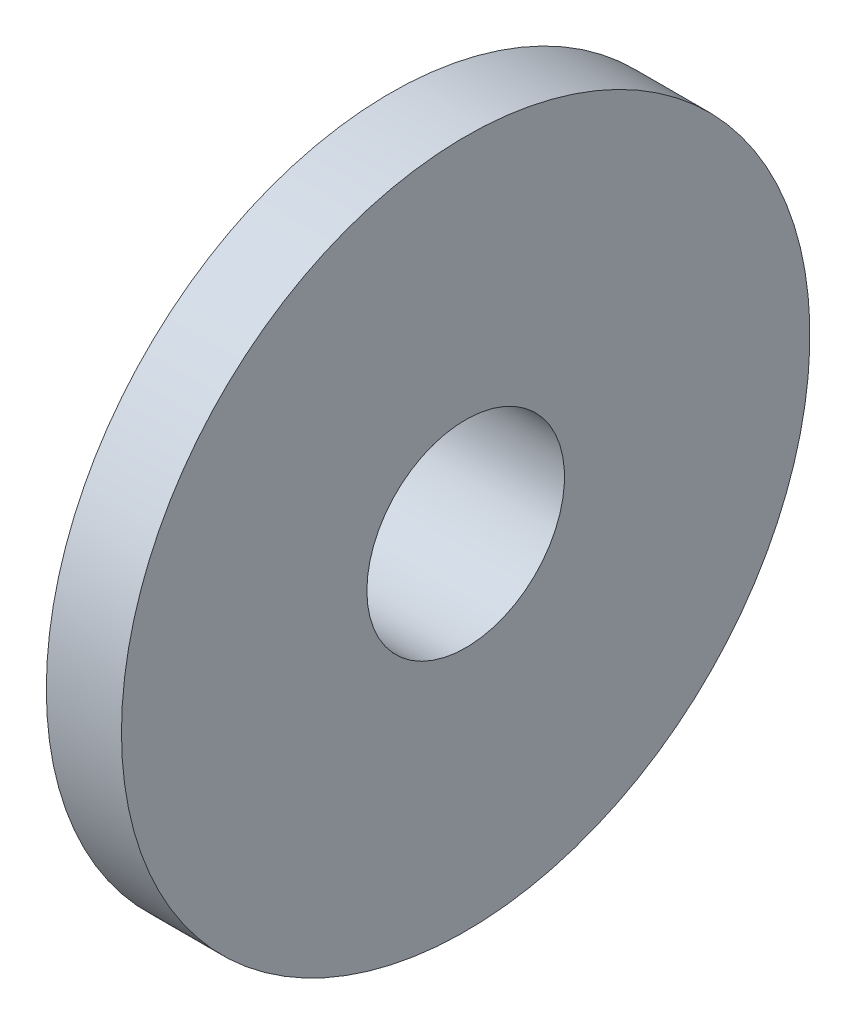
ISO-10303-21;
HEADER;
FILE_DESCRIPTION(('STEP AP214'),'2;1');
FILE_NAME('part.step','',(''),(''),'','','');
FILE_SCHEMA(('AUTOMOTIVE_DESIGN { 1 0 10303 214 1 1 1 1 }'));
ENDSEC;
DATA;
#1=APPLICATION_CONTEXT('core data for automotive mechanical design processes');
#2=APPLICATION_PROTOCOL_DEFINITION('international standard','automotive_design',2000,#1);
#3=PRODUCT_CONTEXT('',#1,'mechanical');
#4=PRODUCT('Part','Part','',(#3));
#5=PRODUCT_RELATED_PRODUCT_CATEGORY('part','',(#4));
#6=PRODUCT_DEFINITION_FORMATION('','',#4);
#7=PRODUCT_DEFINITION_CONTEXT('part definition',#1,'design');
#8=PRODUCT_DEFINITION('design','',#6,#7);
#9=PRODUCT_DEFINITION_SHAPE('','',#8);
#10=(LENGTH_UNIT() NAMED_UNIT(*) SI_UNIT(.MILLI.,.METRE.));
#11=(NAMED_UNIT(*) PLANE_ANGLE_UNIT() SI_UNIT($,.RADIAN.));
#12=(NAMED_UNIT(*) SI_UNIT($,.STERADIAN.) SOLID_ANGLE_UNIT());
#13=UNCERTAINTY_MEASURE_WITH_UNIT(LENGTH_MEASURE(1.E-05),#10,'distance_accuracy_value','');
#14=(GEOMETRIC_REPRESENTATION_CONTEXT(3) GLOBAL_UNCERTAINTY_ASSIGNED_CONTEXT((#13)) GLOBAL_UNIT_ASSIGNED_CONTEXT((#10,
#11,#12)) REPRESENTATION_CONTEXT('',''));
#15=CARTESIAN_POINT('',(0.,0.,0.));
#16=DIRECTION('',(0.,0.,1.));
#17=DIRECTION('',(1.,0.,0.));
#18=AXIS2_PLACEMENT_3D('',#15,#16,#17);
#19=CARTESIAN_POINT('',(-12.0675062027476,0.,-3.00690540133662));
#20=DIRECTION('',(-1.,0.,0.));
#21=DIRECTION('',(0.,0.,1.));
#22=AXIS2_PLACEMENT_3D('',#19,#20,#21);
#23=CYLINDRICAL_SURFACE('',#22,13.2261625659578);
#24=CARTESIAN_POINT('',(-8.73505679111022,0.,-3.00690540133662));
#25=DIRECTION('',(-1.,0.,0.));
#26=DIRECTION('',(0.,0.,1.));
#27=AXIS2_PLACEMENT_3D('',#24,#25,#26);
#28=CIRCLE('',#27,13.2261625659578);
#29=CARTESIAN_POINT('',(-8.73505679111022,0.,10.2192571646212));
#30=VERTEX_POINT('',#29);
#31=EDGE_CURVE('E10',#30,#30,#28,.T.);
#32=ORIENTED_EDGE('',*,*,#31,.F.);
#33=EDGE_LOOP('',(#32));
#34=FACE_BOUND('',#33,.T.);
#35=CARTESIAN_POINT('',(-4.36752839555511,0.,-3.00690540133662));
#36=DIRECTION('',(-1.,0.,0.));
#37=DIRECTION('',(0.,0.,1.));
#38=AXIS2_PLACEMENT_3D('',#35,#36,#37);
#39=CIRCLE('',#38,13.2261625659578);
#40=CARTESIAN_POINT('',(-4.36752839555511,0.,10.2192571646212));
#41=VERTEX_POINT('',#40);
#42=EDGE_CURVE('E64',#41,#41,#39,.T.);
#43=ORIENTED_EDGE('',*,*,#42,.T.);
#44=EDGE_LOOP('',(#43));
#45=FACE_BOUND('',#44,.T.);
#46=ADVANCED_FACE('F37',(#34,#45),#23,.T.);
#47=CARTESIAN_POINT('',(-8.73505679111022,0.,-16.2330679672944));
#48=DIRECTION('',(1.,0.,0.));
#49=DIRECTION('',(0.,0.,-1.));
#50=AXIS2_PLACEMENT_3D('',#47,#48,#49);
#51=PLANE('',#50);
#52=CARTESIAN_POINT('',(-8.73505679111022,0.,-3.00690540133662));
#53=DIRECTION('',(-1.,0.,0.));
#54=DIRECTION('',(0.,0.,1.));
#55=AXIS2_PLACEMENT_3D('',#52,#53,#54);
#56=CIRCLE('',#55,5.74100121775776);
#57=CARTESIAN_POINT('',(-8.73505679111022,0.,2.73409581642113));
#58=VERTEX_POINT('',#57);
#59=EDGE_CURVE('E44',#58,#58,#56,.T.);
#60=ORIENTED_EDGE('',*,*,#59,.F.);
#61=EDGE_LOOP('',(#60));
#62=FACE_BOUND('',#61,.T.);
#63=ORIENTED_EDGE('',*,*,#31,.T.);
#64=EDGE_LOOP('',(#63));
#65=FACE_BOUND('',#64,.T.);
#66=ADVANCED_FACE('F90',(#62,#65),#51,.F.);
#67=CARTESIAN_POINT('',(-12.0675062027476,0.,-3.00690540133662));
#68=DIRECTION('',(-1.,0.,0.));
#69=DIRECTION('',(0.,0.,1.));
#70=AXIS2_PLACEMENT_3D('',#67,#68,#69);
#71=CYLINDRICAL_SURFACE('',#70,5.74100121775776);
#72=CARTESIAN_POINT('',(0.,0.,-3.00690540133662));
#73=DIRECTION('',(-1.,0.,0.));
#74=DIRECTION('',(0.,0.,1.));
#75=AXIS2_PLACEMENT_3D('',#72,#73,#74);
#76=CIRCLE('',#75,5.74100121775776);
#77=CARTESIAN_POINT('',(0.,0.,2.73409581642113));
#78=VERTEX_POINT('',#77);
#79=EDGE_CURVE('E49',#78,#78,#76,.T.);
#80=ORIENTED_EDGE('',*,*,#79,.F.);
#81=EDGE_LOOP('',(#80));
#82=FACE_BOUND('',#81,.T.);
#83=ORIENTED_EDGE('',*,*,#59,.T.);
#84=EDGE_LOOP('',(#83));
#85=FACE_BOUND('',#84,.T.);
#86=ADVANCED_FACE('F85',(#82,#85),#71,.F.);
#87=CARTESIAN_POINT('',(0.,0.,-8.74790661909438));
#88=DIRECTION('',(-1.,0.,0.));
#89=DIRECTION('',(0.,0.,1.));
#90=AXIS2_PLACEMENT_3D('',#87,#88,#89);
#91=PLANE('',#90);
#92=CARTESIAN_POINT('',(0.,0.,-3.00690540133662));
#93=DIRECTION('',(-1.,0.,0.));
#94=DIRECTION('',(0.,0.,1.));
#95=AXIS2_PLACEMENT_3D('',#92,#93,#94);
#96=CIRCLE('',#95,20.);
#97=CARTESIAN_POINT('',(0.,0.,16.9930945986634));
#98=VERTEX_POINT('',#97);
#99=EDGE_CURVE('E54',#98,#98,#96,.T.);
#100=ORIENTED_EDGE('',*,*,#99,.F.);
#101=EDGE_LOOP('',(#100));
#102=FACE_BOUND('',#101,.T.);
#103=ORIENTED_EDGE('',*,*,#79,.T.);
#104=EDGE_LOOP('',(#103));
#105=FACE_BOUND('',#104,.T.);
#106=ADVANCED_FACE('F79',(#102,#105),#91,.F.);
#107=CARTESIAN_POINT('',(-12.0675062027476,0.,-3.00690540133662));
#108=DIRECTION('',(-1.,0.,0.));
#109=DIRECTION('',(0.,0.,1.));
#110=AXIS2_PLACEMENT_3D('',#107,#108,#109);
#111=CYLINDRICAL_SURFACE('',#110,20.);
#112=CARTESIAN_POINT('',(-4.36752839555511,0.,-3.00690540133662));
#113=DIRECTION('',(-1.,0.,0.));
#114=DIRECTION('',(0.,0.,1.));
#115=AXIS2_PLACEMENT_3D('',#112,#113,#114);
#116=CIRCLE('',#115,20.);
#117=CARTESIAN_POINT('',(-4.36752839555511,0.,16.9930945986634));
#118=VERTEX_POINT('',#117);
#119=EDGE_CURVE('E60',#118,#118,#116,.T.);
#120=ORIENTED_EDGE('',*,*,#119,.F.);
#121=EDGE_LOOP('',(#120));
#122=FACE_BOUND('',#121,.T.);
#123=ORIENTED_EDGE('',*,*,#99,.T.);
#124=EDGE_LOOP('',(#123));
#125=FACE_BOUND('',#124,.T.);
#126=ADVANCED_FACE('F73',(#122,#125),#111,.T.);
#127=CARTESIAN_POINT('',(-4.36752839555511,0.,-16.2330679672944));
#128=DIRECTION('',(1.,0.,0.));
#129=DIRECTION('',(0.,0.,-1.));
#130=AXIS2_PLACEMENT_3D('',#127,#128,#129);
#131=PLANE('',#130);
#132=ORIENTED_EDGE('',*,*,#42,.F.);
#133=EDGE_LOOP('',(#132));
#134=FACE_BOUND('',#133,.T.);
#135=ORIENTED_EDGE('',*,*,#119,.T.);
#136=EDGE_LOOP('',(#135));
#137=FACE_BOUND('',#136,.T.);
#138=ADVANCED_FACE('F70',(#134,#137),#131,.F.);
#139=CLOSED_SHELL('',(#46,#66,#86,#106,#126,#138));
#140=MANIFOLD_SOLID_BREP('B2',#139);
#141=ADVANCED_BREP_SHAPE_REPRESENTATION('',(#18,#140),#14);
#142=SHAPE_DEFINITION_REPRESENTATION(#9,#141);
ENDSEC;
END-ISO-10303-21;
